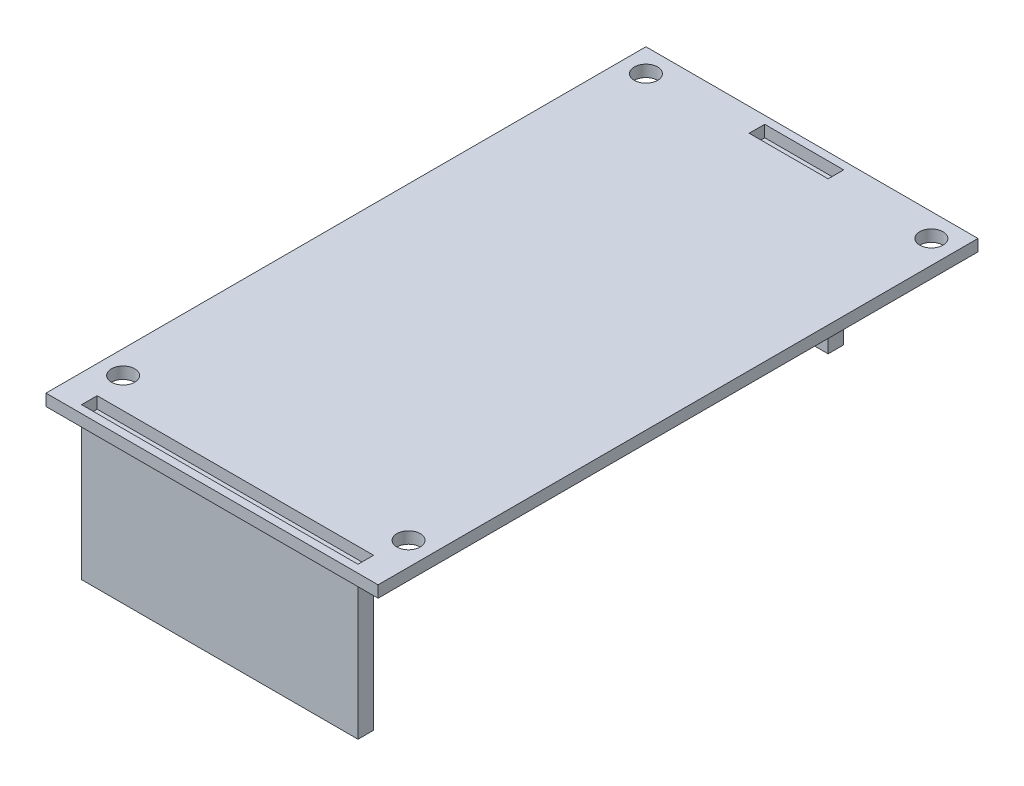
ISO-10303-21;
HEADER;
FILE_DESCRIPTION(('STEP AP214'),'2;1');
FILE_NAME('part.step','',(''),(''),'','','');
FILE_SCHEMA(('AUTOMOTIVE_DESIGN { 1 0 10303 214 1 1 1 1 }'));
ENDSEC;
DATA;
#1=APPLICATION_CONTEXT('core data for automotive mechanical design processes');
#2=APPLICATION_PROTOCOL_DEFINITION('international standard','automotive_design',2000,#1);
#3=PRODUCT_CONTEXT('',#1,'mechanical');
#4=PRODUCT('Part','Part','',(#3));
#5=PRODUCT_RELATED_PRODUCT_CATEGORY('part','',(#4));
#6=PRODUCT_DEFINITION_FORMATION('','',#4);
#7=PRODUCT_DEFINITION_CONTEXT('part definition',#1,'design');
#8=PRODUCT_DEFINITION('design','',#6,#7);
#9=PRODUCT_DEFINITION_SHAPE('','',#8);
#10=(LENGTH_UNIT() NAMED_UNIT(*) SI_UNIT(.MILLI.,.METRE.));
#11=(NAMED_UNIT(*) PLANE_ANGLE_UNIT() SI_UNIT($,.RADIAN.));
#12=(NAMED_UNIT(*) SI_UNIT($,.STERADIAN.) SOLID_ANGLE_UNIT());
#13=UNCERTAINTY_MEASURE_WITH_UNIT(LENGTH_MEASURE(1.E-05),#10,'distance_accuracy_value','');
#14=(GEOMETRIC_REPRESENTATION_CONTEXT(3) GLOBAL_UNCERTAINTY_ASSIGNED_CONTEXT((#13)) GLOBAL_UNIT_ASSIGNED_CONTEXT((#10,
#11,#12)) REPRESENTATION_CONTEXT('',''));
#15=CARTESIAN_POINT('',(0.,0.,0.));
#16=DIRECTION('',(0.,0.,1.));
#17=DIRECTION('',(1.,0.,0.));
#18=AXIS2_PLACEMENT_3D('',#15,#16,#17);
#19=CARTESIAN_POINT('',(26.44,-18.,-74.18));
#20=DIRECTION('',(-1.,0.,0.));
#21=DIRECTION('',(0.,0.,1.));
#22=AXIS2_PLACEMENT_3D('',#19,#20,#21);
#23=PLANE('',#22);
#24=DIRECTION('',(0.,0.,1.));
#25=VECTOR('',#24,1.);
#26=CARTESIAN_POINT('',(26.44,0.,-74.18));
#27=LINE('',#26,#25);
#28=CARTESIAN_POINT('',(26.44,0.,-76.18));
#29=VERTEX_POINT('',#28);
#30=CARTESIAN_POINT('',(26.44,0.,-74.18));
#31=VERTEX_POINT('',#30);
#32=EDGE_CURVE('E107',#29,#31,#27,.T.);
#33=ORIENTED_EDGE('',*,*,#32,.T.);
#34=DIRECTION('',(0.,1.,0.));
#35=VECTOR('',#34,1.);
#36=CARTESIAN_POINT('',(26.44,-18.,-74.18));
#37=LINE('',#36,#35);
#38=CARTESIAN_POINT('',(26.44,-18.,-74.18));
#39=VERTEX_POINT('',#38);
#40=EDGE_CURVE('E12',#39,#31,#37,.T.);
#41=ORIENTED_EDGE('',*,*,#40,.F.);
#42=DIRECTION('',(0.,0.,1.));
#43=VECTOR('',#42,1.);
#44=CARTESIAN_POINT('',(26.44,-18.,-74.18));
#45=LINE('',#44,#43);
#46=CARTESIAN_POINT('',(26.44,-18.,-76.18));
#47=VERTEX_POINT('',#46);
#48=EDGE_CURVE('E95',#47,#39,#45,.T.);
#49=ORIENTED_EDGE('',*,*,#48,.F.);
#50=DIRECTION('',(0.,1.,0.));
#51=VECTOR('',#50,1.);
#52=CARTESIAN_POINT('',(26.44,-18.,-76.18));
#53=LINE('',#52,#51);
#54=EDGE_CURVE('E103',#47,#29,#53,.T.);
#55=ORIENTED_EDGE('',*,*,#54,.T.);
#56=EDGE_LOOP('',(#33,#41,#49,#55));
#57=FACE_BOUND('',#56,.T.);
#58=ADVANCED_FACE('F44',(#57),#23,.F.);
#59=CARTESIAN_POINT('',(26.44,-18.,-74.18));
#60=DIRECTION('',(0.,0.,-1.));
#61=DIRECTION('',(-1.,0.,0.));
#62=AXIS2_PLACEMENT_3D('',#59,#60,#61);
#63=PLANE('',#62);
#64=DIRECTION('',(-1.,0.,0.));
#65=VECTOR('',#64,1.);
#66=CARTESIAN_POINT('',(26.44,0.,-74.18));
#67=LINE('',#66,#65);
#68=CARTESIAN_POINT('',(16.28,0.,-74.18));
#69=VERTEX_POINT('',#68);
#70=EDGE_CURVE('E99',#31,#69,#67,.T.);
#71=ORIENTED_EDGE('',*,*,#70,.T.);
#72=DIRECTION('',(0.,1.,0.));
#73=VECTOR('',#72,1.);
#74=CARTESIAN_POINT('',(16.28,-18.,-74.18));
#75=LINE('',#74,#73);
#76=CARTESIAN_POINT('',(16.28,-18.,-74.18));
#77=VERTEX_POINT('',#76);
#78=EDGE_CURVE('E52',#77,#69,#75,.T.);
#79=ORIENTED_EDGE('',*,*,#78,.F.);
#80=DIRECTION('',(-1.,0.,0.));
#81=VECTOR('',#80,1.);
#82=CARTESIAN_POINT('',(26.44,-18.,-74.18));
#83=LINE('',#82,#81);
#84=EDGE_CURVE('E90',#39,#77,#83,.T.);
#85=ORIENTED_EDGE('',*,*,#84,.F.);
#86=ORIENTED_EDGE('',*,*,#40,.T.);
#87=EDGE_LOOP('',(#71,#79,#85,#86));
#88=FACE_BOUND('',#87,.T.);
#89=ADVANCED_FACE('F98',(#88),#63,.F.);
#90=CARTESIAN_POINT('',(16.28,-18.,-74.18));
#91=DIRECTION('',(1.,0.,0.));
#92=DIRECTION('',(0.,0.,-1.));
#93=AXIS2_PLACEMENT_3D('',#90,#91,#92);
#94=PLANE('',#93);
#95=DIRECTION('',(0.,0.,-1.));
#96=VECTOR('',#95,1.);
#97=CARTESIAN_POINT('',(16.28,0.,-74.18));
#98=LINE('',#97,#96);
#99=CARTESIAN_POINT('',(16.28,0.,-76.18));
#100=VERTEX_POINT('',#99);
#101=EDGE_CURVE('E77',#69,#100,#98,.T.);
#102=ORIENTED_EDGE('',*,*,#101,.T.);
#103=DIRECTION('',(0.,1.,0.));
#104=VECTOR('',#103,1.);
#105=CARTESIAN_POINT('',(16.28,-18.,-76.18));
#106=LINE('',#105,#104);
#107=CARTESIAN_POINT('',(16.28,-18.,-76.18));
#108=VERTEX_POINT('',#107);
#109=EDGE_CURVE('E100',#108,#100,#106,.T.);
#110=ORIENTED_EDGE('',*,*,#109,.F.);
#111=DIRECTION('',(0.,0.,-1.));
#112=VECTOR('',#111,1.);
#113=CARTESIAN_POINT('',(16.28,-18.,-74.18));
#114=LINE('',#113,#112);
#115=EDGE_CURVE('E93',#77,#108,#114,.T.);
#116=ORIENTED_EDGE('',*,*,#115,.F.);
#117=ORIENTED_EDGE('',*,*,#78,.T.);
#118=EDGE_LOOP('',(#102,#110,#116,#117));
#119=FACE_BOUND('',#118,.T.);
#120=ADVANCED_FACE('F101',(#119),#94,.F.);
#121=CARTESIAN_POINT('',(26.44,-18.,-76.18));
#122=DIRECTION('',(0.,0.,1.));
#123=DIRECTION('',(1.,0.,0.));
#124=AXIS2_PLACEMENT_3D('',#121,#122,#123);
#125=PLANE('',#124);
#126=DIRECTION('',(1.,0.,0.));
#127=VECTOR('',#126,1.);
#128=CARTESIAN_POINT('',(26.44,0.,-76.18));
#129=LINE('',#128,#127);
#130=EDGE_CURVE('E83',#100,#29,#129,.T.);
#131=ORIENTED_EDGE('',*,*,#130,.T.);
#132=ORIENTED_EDGE('',*,*,#54,.F.);
#133=DIRECTION('',(1.,0.,0.));
#134=VECTOR('',#133,1.);
#135=CARTESIAN_POINT('',(26.44,-18.,-76.18));
#136=LINE('',#135,#134);
#137=EDGE_CURVE('E60',#108,#47,#136,.T.);
#138=ORIENTED_EDGE('',*,*,#137,.F.);
#139=ORIENTED_EDGE('',*,*,#109,.T.);
#140=EDGE_LOOP('',(#131,#132,#138,#139));
#141=FACE_BOUND('',#140,.T.);
#142=ADVANCED_FACE('F114',(#141),#125,.F.);
#143=CARTESIAN_POINT('',(0.,-18.,0.));
#144=DIRECTION('',(0.,1.,0.));
#145=DIRECTION('',(0.,0.,1.));
#146=AXIS2_PLACEMENT_3D('',#143,#144,#145);
#147=PLANE('',#146);
#148=ORIENTED_EDGE('',*,*,#48,.T.);
#149=ORIENTED_EDGE('',*,*,#84,.T.);
#150=ORIENTED_EDGE('',*,*,#115,.T.);
#151=ORIENTED_EDGE('',*,*,#137,.T.);
#152=EDGE_LOOP('',(#148,#149,#150,#151));
#153=FACE_BOUND('',#152,.T.);
#154=ADVANCED_FACE('F91',(#153),#147,.F.);
#155=CARTESIAN_POINT('',(0.,0.,0.));
#156=DIRECTION('',(0.,1.,0.));
#157=DIRECTION('',(0.,0.,1.));
#158=AXIS2_PLACEMENT_3D('',#155,#156,#157);
#159=PLANE('',#158);
#160=ORIENTED_EDGE('',*,*,#32,.F.);
#161=ORIENTED_EDGE('',*,*,#130,.F.);
#162=ORIENTED_EDGE('',*,*,#101,.F.);
#163=ORIENTED_EDGE('',*,*,#70,.F.);
#164=EDGE_LOOP('',(#160,#161,#162,#163));
#165=FACE_BOUND('',#164,.T.);
#166=ADVANCED_FACE('F117',(#165),#159,.T.);
#167=CLOSED_SHELL('',(#58,#89,#120,#142,#154,#166));
#168=MANIFOLD_SOLID_BREP('B2',#167);
#169=CARTESIAN_POINT('',(39.14,-18.,-1.));
#170=DIRECTION('',(-1.,0.,0.));
#171=DIRECTION('',(0.,0.,1.));
#172=AXIS2_PLACEMENT_3D('',#169,#170,#171);
#173=PLANE('',#172);
#174=DIRECTION('',(0.,0.,1.));
#175=VECTOR('',#174,1.);
#176=CARTESIAN_POINT('',(39.14,0.,-1.));
#177=LINE('',#176,#175);
#178=CARTESIAN_POINT('',(39.14,0.,-3.));
#179=VERTEX_POINT('',#178);
#180=CARTESIAN_POINT('',(39.14,0.,-1.));
#181=VERTEX_POINT('',#180);
#182=EDGE_CURVE('E240',#179,#181,#177,.T.);
#183=ORIENTED_EDGE('',*,*,#182,.T.);
#184=DIRECTION('',(0.,1.,0.));
#185=VECTOR('',#184,1.);
#186=CARTESIAN_POINT('',(39.14,-18.,-1.));
#187=LINE('',#186,#185);
#188=CARTESIAN_POINT('',(39.14,-18.,-1.));
#189=VERTEX_POINT('',#188);
#190=EDGE_CURVE('E42',#189,#181,#187,.T.);
#191=ORIENTED_EDGE('',*,*,#190,.F.);
#192=DIRECTION('',(0.,0.,1.));
#193=VECTOR('',#192,1.);
#194=CARTESIAN_POINT('',(39.14,-18.,-1.));
#195=LINE('',#194,#193);
#196=CARTESIAN_POINT('',(39.14,-18.,-3.));
#197=VERTEX_POINT('',#196);
#198=EDGE_CURVE('E228',#197,#189,#195,.T.);
#199=ORIENTED_EDGE('',*,*,#198,.F.);
#200=DIRECTION('',(0.,1.,0.));
#201=VECTOR('',#200,1.);
#202=CARTESIAN_POINT('',(39.14,-18.,-3.));
#203=LINE('',#202,#201);
#204=EDGE_CURVE('E236',#197,#179,#203,.T.);
#205=ORIENTED_EDGE('',*,*,#204,.T.);
#206=EDGE_LOOP('',(#183,#191,#199,#205));
#207=FACE_BOUND('',#206,.T.);
#208=ADVANCED_FACE('F177',(#207),#173,.F.);
#209=CARTESIAN_POINT('',(39.14,-18.,-1.));
#210=DIRECTION('',(0.,0.,-1.));
#211=DIRECTION('',(-1.,0.,0.));
#212=AXIS2_PLACEMENT_3D('',#209,#210,#211);
#213=PLANE('',#212);
#214=DIRECTION('',(-1.,0.,0.));
#215=VECTOR('',#214,1.);
#216=CARTESIAN_POINT('',(39.14,0.,-1.));
#217=LINE('',#216,#215);
#218=CARTESIAN_POINT('',(3.58,0.,-1.));
#219=VERTEX_POINT('',#218);
#220=EDGE_CURVE('E232',#181,#219,#217,.T.);
#221=ORIENTED_EDGE('',*,*,#220,.T.);
#222=DIRECTION('',(0.,1.,0.));
#223=VECTOR('',#222,1.);
#224=CARTESIAN_POINT('',(3.58,-18.,-1.));
#225=LINE('',#224,#223);
#226=CARTESIAN_POINT('',(3.58,-18.,-1.));
#227=VERTEX_POINT('',#226);
#228=EDGE_CURVE('E185',#227,#219,#225,.T.);
#229=ORIENTED_EDGE('',*,*,#228,.F.);
#230=DIRECTION('',(-1.,0.,0.));
#231=VECTOR('',#230,1.);
#232=CARTESIAN_POINT('',(39.14,-18.,-1.));
#233=LINE('',#232,#231);
#234=EDGE_CURVE('E223',#189,#227,#233,.T.);
#235=ORIENTED_EDGE('',*,*,#234,.F.);
#236=ORIENTED_EDGE('',*,*,#190,.T.);
#237=EDGE_LOOP('',(#221,#229,#235,#236));
#238=FACE_BOUND('',#237,.T.);
#239=ADVANCED_FACE('F231',(#238),#213,.F.);
#240=CARTESIAN_POINT('',(3.58,-18.,-1.));
#241=DIRECTION('',(1.,0.,0.));
#242=DIRECTION('',(0.,0.,-1.));
#243=AXIS2_PLACEMENT_3D('',#240,#241,#242);
#244=PLANE('',#243);
#245=DIRECTION('',(0.,0.,-1.));
#246=VECTOR('',#245,1.);
#247=CARTESIAN_POINT('',(3.58,0.,-1.));
#248=LINE('',#247,#246);
#249=CARTESIAN_POINT('',(3.58,0.,-3.));
#250=VERTEX_POINT('',#249);
#251=EDGE_CURVE('E210',#219,#250,#248,.T.);
#252=ORIENTED_EDGE('',*,*,#251,.T.);
#253=DIRECTION('',(0.,1.,0.));
#254=VECTOR('',#253,1.);
#255=CARTESIAN_POINT('',(3.58,-18.,-3.));
#256=LINE('',#255,#254);
#257=CARTESIAN_POINT('',(3.58,-18.,-3.));
#258=VERTEX_POINT('',#257);
#259=EDGE_CURVE('E233',#258,#250,#256,.T.);
#260=ORIENTED_EDGE('',*,*,#259,.F.);
#261=DIRECTION('',(0.,0.,-1.));
#262=VECTOR('',#261,1.);
#263=CARTESIAN_POINT('',(3.58,-18.,-1.));
#264=LINE('',#263,#262);
#265=EDGE_CURVE('E226',#227,#258,#264,.T.);
#266=ORIENTED_EDGE('',*,*,#265,.F.);
#267=ORIENTED_EDGE('',*,*,#228,.T.);
#268=EDGE_LOOP('',(#252,#260,#266,#267));
#269=FACE_BOUND('',#268,.T.);
#270=ADVANCED_FACE('F234',(#269),#244,.F.);
#271=CARTESIAN_POINT('',(39.14,-18.,-3.));
#272=DIRECTION('',(0.,0.,1.));
#273=DIRECTION('',(1.,0.,0.));
#274=AXIS2_PLACEMENT_3D('',#271,#272,#273);
#275=PLANE('',#274);
#276=DIRECTION('',(1.,0.,0.));
#277=VECTOR('',#276,1.);
#278=CARTESIAN_POINT('',(39.14,0.,-3.));
#279=LINE('',#278,#277);
#280=EDGE_CURVE('E216',#250,#179,#279,.T.);
#281=ORIENTED_EDGE('',*,*,#280,.T.);
#282=ORIENTED_EDGE('',*,*,#204,.F.);
#283=DIRECTION('',(1.,0.,0.));
#284=VECTOR('',#283,1.);
#285=CARTESIAN_POINT('',(39.14,-18.,-3.));
#286=LINE('',#285,#284);
#287=EDGE_CURVE('E193',#258,#197,#286,.T.);
#288=ORIENTED_EDGE('',*,*,#287,.F.);
#289=ORIENTED_EDGE('',*,*,#259,.T.);
#290=EDGE_LOOP('',(#281,#282,#288,#289));
#291=FACE_BOUND('',#290,.T.);
#292=ADVANCED_FACE('F247',(#291),#275,.F.);
#293=CARTESIAN_POINT('',(0.,-18.,0.));
#294=DIRECTION('',(0.,1.,0.));
#295=DIRECTION('',(0.,0.,1.));
#296=AXIS2_PLACEMENT_3D('',#293,#294,#295);
#297=PLANE('',#296);
#298=ORIENTED_EDGE('',*,*,#198,.T.);
#299=ORIENTED_EDGE('',*,*,#234,.T.);
#300=ORIENTED_EDGE('',*,*,#265,.T.);
#301=ORIENTED_EDGE('',*,*,#287,.T.);
#302=EDGE_LOOP('',(#298,#299,#300,#301));
#303=FACE_BOUND('',#302,.T.);
#304=ADVANCED_FACE('F224',(#303),#297,.F.);
#305=CARTESIAN_POINT('',(0.,0.,0.));
#306=DIRECTION('',(0.,1.,0.));
#307=DIRECTION('',(0.,0.,1.));
#308=AXIS2_PLACEMENT_3D('',#305,#306,#307);
#309=PLANE('',#308);
#310=ORIENTED_EDGE('',*,*,#182,.F.);
#311=ORIENTED_EDGE('',*,*,#280,.F.);
#312=ORIENTED_EDGE('',*,*,#251,.F.);
#313=ORIENTED_EDGE('',*,*,#220,.F.);
#314=EDGE_LOOP('',(#310,#311,#312,#313));
#315=FACE_BOUND('',#314,.T.);
#316=ADVANCED_FACE('F250',(#315),#309,.T.);
#317=CLOSED_SHELL('',(#208,#239,#270,#292,#304,#316));
#318=MANIFOLD_SOLID_BREP('B6',#317);
#319=CARTESIAN_POINT('',(0.,1.5,0.));
#320=DIRECTION('',(0.,-1.,0.));
#321=DIRECTION('',(0.,0.,-1.));
#322=AXIS2_PLACEMENT_3D('',#319,#320,#321);
#323=PLANE('',#322);
#324=DIRECTION('',(0.,0.,1.));
#325=VECTOR('',#324,1.);
#326=CARTESIAN_POINT('',(3.58,1.5,-1.));
#327=LINE('',#326,#325);
#328=CARTESIAN_POINT('',(3.58,1.5,-3.));
#329=VERTEX_POINT('',#328);
#330=CARTESIAN_POINT('',(3.58,1.5,-1.));
#331=VERTEX_POINT('',#330);
#332=EDGE_CURVE('E426',#329,#331,#327,.T.);
#333=ORIENTED_EDGE('',*,*,#332,.F.);
#334=DIRECTION('',(-1.,0.,0.));
#335=VECTOR('',#334,1.);
#336=CARTESIAN_POINT('',(3.58,1.5,-3.));
#337=LINE('',#336,#335);
#338=CARTESIAN_POINT('',(39.14,1.5,-3.));
#339=VERTEX_POINT('',#338);
#340=EDGE_CURVE('E434',#339,#329,#337,.T.);
#341=ORIENTED_EDGE('',*,*,#340,.F.);
#342=DIRECTION('',(0.,0.,-1.));
#343=VECTOR('',#342,1.);
#344=CARTESIAN_POINT('',(39.14,1.5,-1.));
#345=LINE('',#344,#343);
#346=CARTESIAN_POINT('',(39.14,1.5,-1.));
#347=VERTEX_POINT('',#346);
#348=EDGE_CURVE('E431',#347,#339,#345,.T.);
#349=ORIENTED_EDGE('',*,*,#348,.F.);
#350=DIRECTION('',(1.,0.,0.));
#351=VECTOR('',#350,1.);
#352=CARTESIAN_POINT('',(3.58,1.5,-1.));
#353=LINE('',#352,#351);
#354=EDGE_CURVE('E428',#331,#347,#353,.T.);
#355=ORIENTED_EDGE('',*,*,#354,.F.);
#356=EDGE_LOOP('',(#333,#341,#349,#355));
#357=FACE_BOUND('',#356,.T.);
#358=DIRECTION('',(0.,0.,1.));
#359=VECTOR('',#358,1.);
#360=CARTESIAN_POINT('',(0.,1.5,0.));
#361=LINE('',#360,#359);
#362=CARTESIAN_POINT('',(0.,1.5,-77.18));
#363=VERTEX_POINT('',#362);
#364=CARTESIAN_POINT('',(0.,1.5,0.));
#365=VERTEX_POINT('',#364);
#366=EDGE_CURVE('E481',#363,#365,#361,.T.);
#367=ORIENTED_EDGE('',*,*,#366,.T.);
#368=DIRECTION('',(1.,0.,0.));
#369=VECTOR('',#368,1.);
#370=CARTESIAN_POINT('',(0.,1.5,0.));
#371=LINE('',#370,#369);
#372=CARTESIAN_POINT('',(42.72,1.5,0.));
#373=VERTEX_POINT('',#372);
#374=EDGE_CURVE('E484',#365,#373,#371,.T.);
#375=ORIENTED_EDGE('',*,*,#374,.T.);
#376=DIRECTION('',(0.,0.,-1.));
#377=VECTOR('',#376,1.);
#378=CARTESIAN_POINT('',(42.72,1.5,0.));
#379=LINE('',#378,#377);
#380=CARTESIAN_POINT('',(42.72,1.5,-77.18));
#381=VERTEX_POINT('',#380);
#382=EDGE_CURVE('E487',#373,#381,#379,.T.);
#383=ORIENTED_EDGE('',*,*,#382,.T.);
#384=DIRECTION('',(-1.,0.,0.));
#385=VECTOR('',#384,1.);
#386=CARTESIAN_POINT('',(0.,1.5,-77.18));
#387=LINE('',#386,#385);
#388=EDGE_CURVE('E489',#381,#363,#387,.T.);
#389=ORIENTED_EDGE('',*,*,#388,.T.);
#390=EDGE_LOOP('',(#367,#375,#383,#389));
#391=FACE_BOUND('',#390,.T.);
#392=CARTESIAN_POINT('',(39.72,1.5,-74.18));
#393=DIRECTION('',(0.,1.,0.));
#394=DIRECTION('',(0.,0.,1.));
#395=AXIS2_PLACEMENT_3D('',#392,#393,#394);
#396=CIRCLE('',#395,1.5);
#397=CARTESIAN_POINT('',(39.72,1.5,-72.68));
#398=VERTEX_POINT('',#397);
#399=EDGE_CURVE('E475',#398,#398,#396,.T.);
#400=ORIENTED_EDGE('',*,*,#399,.F.);
#401=EDGE_LOOP('',(#400));
#402=FACE_BOUND('',#401,.T.);
#403=CARTESIAN_POINT('',(3.,1.5,-74.18));
#404=DIRECTION('',(0.,1.,0.));
#405=DIRECTION('',(0.,0.,1.));
#406=AXIS2_PLACEMENT_3D('',#403,#404,#405);
#407=CIRCLE('',#406,1.5);
#408=CARTESIAN_POINT('',(3.,1.5,-72.68));
#409=VERTEX_POINT('',#408);
#410=EDGE_CURVE('E469',#409,#409,#407,.T.);
#411=ORIENTED_EDGE('',*,*,#410,.F.);
#412=EDGE_LOOP('',(#411));
#413=FACE_BOUND('',#412,.T.);
#414=CARTESIAN_POINT('',(3.,1.5,-6.92));
#415=DIRECTION('',(0.,1.,0.));
#416=DIRECTION('',(0.,0.,1.));
#417=AXIS2_PLACEMENT_3D('',#414,#415,#416);
#418=CIRCLE('',#417,1.5);
#419=CARTESIAN_POINT('',(3.,1.5,-5.42));
#420=VERTEX_POINT('',#419);
#421=EDGE_CURVE('E463',#420,#420,#418,.T.);
#422=ORIENTED_EDGE('',*,*,#421,.F.);
#423=EDGE_LOOP('',(#422));
#424=FACE_BOUND('',#423,.T.);
#425=CARTESIAN_POINT('',(39.72,1.5,-6.92));
#426=DIRECTION('',(0.,1.,0.));
#427=DIRECTION('',(0.,0.,1.));
#428=AXIS2_PLACEMENT_3D('',#425,#426,#427);
#429=CIRCLE('',#428,1.5);
#430=CARTESIAN_POINT('',(39.72,1.5,-5.42));
#431=VERTEX_POINT('',#430);
#432=EDGE_CURVE('E457',#431,#431,#429,.T.);
#433=ORIENTED_EDGE('',*,*,#432,.F.);
#434=EDGE_LOOP('',(#433));
#435=FACE_BOUND('',#434,.T.);
#436=DIRECTION('',(0.,0.,1.));
#437=VECTOR('',#436,1.);
#438=CARTESIAN_POINT('',(16.28,1.5,-76.18));
#439=LINE('',#438,#437);
#440=CARTESIAN_POINT('',(16.28,1.5,-76.18));
#441=VERTEX_POINT('',#440);
#442=CARTESIAN_POINT('',(16.28,1.5,-74.18));
#443=VERTEX_POINT('',#442);
#444=EDGE_CURVE('E390',#441,#443,#439,.T.);
#445=ORIENTED_EDGE('',*,*,#444,.F.);
#446=DIRECTION('',(-1.,0.,0.));
#447=VECTOR('',#446,1.);
#448=CARTESIAN_POINT('',(16.28,1.5,-76.18));
#449=LINE('',#448,#447);
#450=CARTESIAN_POINT('',(26.44,1.5,-76.18));
#451=VERTEX_POINT('',#450);
#452=EDGE_CURVE('E412',#451,#441,#449,.T.);
#453=ORIENTED_EDGE('',*,*,#452,.F.);
#454=DIRECTION('',(0.,0.,-1.));
#455=VECTOR('',#454,1.);
#456=CARTESIAN_POINT('',(26.44,1.5,-76.18));
#457=LINE('',#456,#455);
#458=CARTESIAN_POINT('',(26.44,1.5,-74.18));
#459=VERTEX_POINT('',#458);
#460=EDGE_CURVE('E410',#459,#451,#457,.T.);
#461=ORIENTED_EDGE('',*,*,#460,.F.);
#462=DIRECTION('',(1.,0.,0.));
#463=VECTOR('',#462,1.);
#464=CARTESIAN_POINT('',(16.28,1.5,-74.18));
#465=LINE('',#464,#463);
#466=EDGE_CURVE('E398',#443,#459,#465,.T.);
#467=ORIENTED_EDGE('',*,*,#466,.F.);
#468=EDGE_LOOP('',(#445,#453,#461,#467));
#469=FACE_BOUND('',#468,.T.);
#470=ADVANCED_FACE('F301',(#357,#391,#402,#413,#424,#435,#469),#323,.F.);
#471=CARTESIAN_POINT('',(0.,0.,0.));
#472=DIRECTION('',(0.,-1.,0.));
#473=DIRECTION('',(0.,0.,-1.));
#474=AXIS2_PLACEMENT_3D('',#471,#472,#473);
#475=PLANE('',#474);
#476=CARTESIAN_POINT('',(3.,0.,-6.92));
#477=DIRECTION('',(0.,1.,0.));
#478=DIRECTION('',(0.,0.,1.));
#479=AXIS2_PLACEMENT_3D('',#476,#477,#478);
#480=CIRCLE('',#479,1.5);
#481=CARTESIAN_POINT('',(3.,0.,-5.42));
#482=VERTEX_POINT('',#481);
#483=EDGE_CURVE('E460',#482,#482,#480,.T.);
#484=ORIENTED_EDGE('',*,*,#483,.T.);
#485=EDGE_LOOP('',(#484));
#486=FACE_BOUND('',#485,.T.);
#487=CARTESIAN_POINT('',(39.72,0.,-74.18));
#488=DIRECTION('',(0.,1.,0.));
#489=DIRECTION('',(0.,0.,1.));
#490=AXIS2_PLACEMENT_3D('',#487,#488,#489);
#491=CIRCLE('',#490,1.5);
#492=CARTESIAN_POINT('',(39.72,0.,-72.68));
#493=VERTEX_POINT('',#492);
#494=EDGE_CURVE('E472',#493,#493,#491,.T.);
#495=ORIENTED_EDGE('',*,*,#494,.T.);
#496=EDGE_LOOP('',(#495));
#497=FACE_BOUND('',#496,.T.);
#498=DIRECTION('',(0.,0.,1.));
#499=VECTOR('',#498,1.);
#500=CARTESIAN_POINT('',(0.,0.,0.));
#501=LINE('',#500,#499);
#502=CARTESIAN_POINT('',(0.,0.,-77.18));
#503=VERTEX_POINT('',#502);
#504=CARTESIAN_POINT('',(0.,0.,0.));
#505=VERTEX_POINT('',#504);
#506=EDGE_CURVE('E478',#503,#505,#501,.T.);
#507=ORIENTED_EDGE('',*,*,#506,.F.);
#508=DIRECTION('',(-1.,0.,0.));
#509=VECTOR('',#508,1.);
#510=CARTESIAN_POINT('',(0.,0.,-77.18));
#511=LINE('',#510,#509);
#512=CARTESIAN_POINT('',(42.72,0.,-77.18));
#513=VERTEX_POINT('',#512);
#514=EDGE_CURVE('E485',#513,#503,#511,.T.);
#515=ORIENTED_EDGE('',*,*,#514,.F.);
#516=DIRECTION('',(0.,0.,-1.));
#517=VECTOR('',#516,1.);
#518=CARTESIAN_POINT('',(42.72,0.,0.));
#519=LINE('',#518,#517);
#520=CARTESIAN_POINT('',(42.72,0.,0.));
#521=VERTEX_POINT('',#520);
#522=EDGE_CURVE('E496',#521,#513,#519,.T.);
#523=ORIENTED_EDGE('',*,*,#522,.F.);
#524=DIRECTION('',(1.,0.,0.));
#525=VECTOR('',#524,1.);
#526=CARTESIAN_POINT('',(0.,0.,0.));
#527=LINE('',#526,#525);
#528=EDGE_CURVE('E494',#505,#521,#527,.T.);
#529=ORIENTED_EDGE('',*,*,#528,.F.);
#530=EDGE_LOOP('',(#507,#515,#523,#529));
#531=FACE_BOUND('',#530,.T.);
#532=CARTESIAN_POINT('',(3.,0.,-74.18));
#533=DIRECTION('',(0.,1.,0.));
#534=DIRECTION('',(0.,0.,1.));
#535=AXIS2_PLACEMENT_3D('',#532,#533,#534);
#536=CIRCLE('',#535,1.5);
#537=CARTESIAN_POINT('',(3.,0.,-72.68));
#538=VERTEX_POINT('',#537);
#539=EDGE_CURVE('E466',#538,#538,#536,.T.);
#540=ORIENTED_EDGE('',*,*,#539,.T.);
#541=EDGE_LOOP('',(#540));
#542=FACE_BOUND('',#541,.T.);
#543=CARTESIAN_POINT('',(39.72,0.,-6.92));
#544=DIRECTION('',(0.,1.,0.));
#545=DIRECTION('',(0.,0.,1.));
#546=AXIS2_PLACEMENT_3D('',#543,#544,#545);
#547=CIRCLE('',#546,1.5);
#548=CARTESIAN_POINT('',(39.72,0.,-5.42));
#549=VERTEX_POINT('',#548);
#550=EDGE_CURVE('E456',#549,#549,#547,.T.);
#551=ORIENTED_EDGE('',*,*,#550,.T.);
#552=EDGE_LOOP('',(#551));
#553=FACE_BOUND('',#552,.T.);
#554=DIRECTION('',(-1.,0.,0.));
#555=VECTOR('',#554,1.);
#556=CARTESIAN_POINT('',(3.58,0.,-3.));
#557=LINE('',#556,#555);
#558=CARTESIAN_POINT('',(39.14,0.,-3.));
#559=VERTEX_POINT('',#558);
#560=CARTESIAN_POINT('',(3.58,0.,-3.));
#561=VERTEX_POINT('',#560);
#562=EDGE_CURVE('E429',#559,#561,#557,.T.);
#563=ORIENTED_EDGE('',*,*,#562,.T.);
#564=DIRECTION('',(0.,0.,1.));
#565=VECTOR('',#564,1.);
#566=CARTESIAN_POINT('',(3.58,0.,-1.));
#567=LINE('',#566,#565);
#568=CARTESIAN_POINT('',(3.58,0.,-1.));
#569=VERTEX_POINT('',#568);
#570=EDGE_CURVE('E406',#561,#569,#567,.T.);
#571=ORIENTED_EDGE('',*,*,#570,.T.);
#572=DIRECTION('',(1.,0.,0.));
#573=VECTOR('',#572,1.);
#574=CARTESIAN_POINT('',(3.58,0.,-1.));
#575=LINE('',#574,#573);
#576=CARTESIAN_POINT('',(39.14,0.,-1.));
#577=VERTEX_POINT('',#576);
#578=EDGE_CURVE('E439',#569,#577,#575,.T.);
#579=ORIENTED_EDGE('',*,*,#578,.T.);
#580=DIRECTION('',(0.,0.,-1.));
#581=VECTOR('',#580,1.);
#582=CARTESIAN_POINT('',(39.14,0.,-1.));
#583=LINE('',#582,#581);
#584=EDGE_CURVE('E442',#577,#559,#583,.T.);
#585=ORIENTED_EDGE('',*,*,#584,.T.);
#586=EDGE_LOOP('',(#563,#571,#579,#585));
#587=FACE_BOUND('',#586,.T.);
#588=DIRECTION('',(-1.,0.,0.));
#589=VECTOR('',#588,1.);
#590=CARTESIAN_POINT('',(16.28,0.,-76.18));
#591=LINE('',#590,#589);
#592=CARTESIAN_POINT('',(26.44,0.,-76.18));
#593=VERTEX_POINT('',#592);
#594=CARTESIAN_POINT('',(16.28,0.,-76.18));
#595=VERTEX_POINT('',#594);
#596=EDGE_CURVE('E399',#593,#595,#591,.T.);
#597=ORIENTED_EDGE('',*,*,#596,.T.);
#598=DIRECTION('',(0.,0.,1.));
#599=VECTOR('',#598,1.);
#600=CARTESIAN_POINT('',(16.28,0.,-76.18));
#601=LINE('',#600,#599);
#602=CARTESIAN_POINT('',(16.28,0.,-74.18));
#603=VERTEX_POINT('',#602);
#604=EDGE_CURVE('E324',#595,#603,#601,.T.);
#605=ORIENTED_EDGE('',*,*,#604,.T.);
#606=DIRECTION('',(1.,0.,0.));
#607=VECTOR('',#606,1.);
#608=CARTESIAN_POINT('',(16.28,0.,-74.18));
#609=LINE('',#608,#607);
#610=CARTESIAN_POINT('',(26.44,0.,-74.18));
#611=VERTEX_POINT('',#610);
#612=EDGE_CURVE('E405',#603,#611,#609,.T.);
#613=ORIENTED_EDGE('',*,*,#612,.T.);
#614=DIRECTION('',(0.,0.,-1.));
#615=VECTOR('',#614,1.);
#616=CARTESIAN_POINT('',(26.44,0.,-76.18));
#617=LINE('',#616,#615);
#618=EDGE_CURVE('E418',#611,#593,#617,.T.);
#619=ORIENTED_EDGE('',*,*,#618,.T.);
#620=EDGE_LOOP('',(#597,#605,#613,#619));
#621=FACE_BOUND('',#620,.T.);
#622=ADVANCED_FACE('F514',(#486,#497,#531,#542,#553,#587,#621),#475,.T.);
#623=CARTESIAN_POINT('',(0.,1.5,0.));
#624=DIRECTION('',(1.,0.,0.));
#625=DIRECTION('',(0.,0.,-1.));
#626=AXIS2_PLACEMENT_3D('',#623,#624,#625);
#627=PLANE('',#626);
#628=ORIENTED_EDGE('',*,*,#506,.T.);
#629=DIRECTION('',(0.,-1.,0.));
#630=VECTOR('',#629,1.);
#631=CARTESIAN_POINT('',(0.,1.5,0.));
#632=LINE('',#631,#630);
#633=EDGE_CURVE('E175',#365,#505,#632,.T.);
#634=ORIENTED_EDGE('',*,*,#633,.F.);
#635=ORIENTED_EDGE('',*,*,#366,.F.);
#636=DIRECTION('',(0.,-1.,0.));
#637=VECTOR('',#636,1.);
#638=CARTESIAN_POINT('',(0.,1.5,-77.18));
#639=LINE('',#638,#637);
#640=EDGE_CURVE('E491',#363,#503,#639,.T.);
#641=ORIENTED_EDGE('',*,*,#640,.T.);
#642=EDGE_LOOP('',(#628,#634,#635,#641));
#643=FACE_BOUND('',#642,.T.);
#644=ADVANCED_FACE('F303',(#643),#627,.F.);
#645=CARTESIAN_POINT('',(0.,1.5,0.));
#646=DIRECTION('',(0.,0.,-1.));
#647=DIRECTION('',(-1.,0.,0.));
#648=AXIS2_PLACEMENT_3D('',#645,#646,#647);
#649=PLANE('',#648);
#650=ORIENTED_EDGE('',*,*,#528,.T.);
#651=DIRECTION('',(0.,-1.,0.));
#652=VECTOR('',#651,1.);
#653=CARTESIAN_POINT('',(42.72,1.5,0.));
#654=LINE('',#653,#652);
#655=EDGE_CURVE('E309',#373,#521,#654,.T.);
#656=ORIENTED_EDGE('',*,*,#655,.F.);
#657=ORIENTED_EDGE('',*,*,#374,.F.);
#658=ORIENTED_EDGE('',*,*,#633,.T.);
#659=EDGE_LOOP('',(#650,#656,#657,#658));
#660=FACE_BOUND('',#659,.T.);
#661=ADVANCED_FACE('F525',(#660),#649,.F.);
#662=CARTESIAN_POINT('',(42.72,1.5,0.));
#663=DIRECTION('',(-1.,0.,0.));
#664=DIRECTION('',(0.,0.,1.));
#665=AXIS2_PLACEMENT_3D('',#662,#663,#664);
#666=PLANE('',#665);
#667=ORIENTED_EDGE('',*,*,#522,.T.);
#668=DIRECTION('',(0.,-1.,0.));
#669=VECTOR('',#668,1.);
#670=CARTESIAN_POINT('',(42.72,1.5,-77.18));
#671=LINE('',#670,#669);
#672=EDGE_CURVE('E501',#381,#513,#671,.T.);
#673=ORIENTED_EDGE('',*,*,#672,.F.);
#674=ORIENTED_EDGE('',*,*,#382,.F.);
#675=ORIENTED_EDGE('',*,*,#655,.T.);
#676=EDGE_LOOP('',(#667,#673,#674,#675));
#677=FACE_BOUND('',#676,.T.);
#678=ADVANCED_FACE('F508',(#677),#666,.F.);
#679=CARTESIAN_POINT('',(0.,1.5,-77.18));
#680=DIRECTION('',(0.,0.,1.));
#681=DIRECTION('',(1.,0.,0.));
#682=AXIS2_PLACEMENT_3D('',#679,#680,#681);
#683=PLANE('',#682);
#684=ORIENTED_EDGE('',*,*,#514,.T.);
#685=ORIENTED_EDGE('',*,*,#640,.F.);
#686=ORIENTED_EDGE('',*,*,#388,.F.);
#687=ORIENTED_EDGE('',*,*,#672,.T.);
#688=EDGE_LOOP('',(#684,#685,#686,#687));
#689=FACE_BOUND('',#688,.T.);
#690=ADVANCED_FACE('F518',(#689),#683,.F.);
#691=CARTESIAN_POINT('',(39.72,1.5,-74.18));
#692=DIRECTION('',(0.,-1.,0.));
#693=DIRECTION('',(0.,0.,-1.));
#694=AXIS2_PLACEMENT_3D('',#691,#692,#693);
#695=CYLINDRICAL_SURFACE('',#694,1.5);
#696=ORIENTED_EDGE('',*,*,#399,.T.);
#697=EDGE_LOOP('',(#696));
#698=FACE_BOUND('',#697,.T.);
#699=ORIENTED_EDGE('',*,*,#494,.F.);
#700=EDGE_LOOP('',(#699));
#701=FACE_BOUND('',#700,.T.);
#702=ADVANCED_FACE('F542',(#698,#701),#695,.F.);
#703=CARTESIAN_POINT('',(3.,1.5,-74.18));
#704=DIRECTION('',(0.,-1.,0.));
#705=DIRECTION('',(0.,0.,-1.));
#706=AXIS2_PLACEMENT_3D('',#703,#704,#705);
#707=CYLINDRICAL_SURFACE('',#706,1.5);
#708=ORIENTED_EDGE('',*,*,#410,.T.);
#709=EDGE_LOOP('',(#708));
#710=FACE_BOUND('',#709,.T.);
#711=ORIENTED_EDGE('',*,*,#539,.F.);
#712=EDGE_LOOP('',(#711));
#713=FACE_BOUND('',#712,.T.);
#714=ADVANCED_FACE('F549',(#710,#713),#707,.F.);
#715=CARTESIAN_POINT('',(3.,1.5,-6.92));
#716=DIRECTION('',(0.,-1.,0.));
#717=DIRECTION('',(0.,0.,-1.));
#718=AXIS2_PLACEMENT_3D('',#715,#716,#717);
#719=CYLINDRICAL_SURFACE('',#718,1.5);
#720=ORIENTED_EDGE('',*,*,#421,.T.);
#721=EDGE_LOOP('',(#720));
#722=FACE_BOUND('',#721,.T.);
#723=ORIENTED_EDGE('',*,*,#483,.F.);
#724=EDGE_LOOP('',(#723));
#725=FACE_BOUND('',#724,.T.);
#726=ADVANCED_FACE('F554',(#722,#725),#719,.F.);
#727=CARTESIAN_POINT('',(39.72,1.5,-6.92));
#728=DIRECTION('',(0.,-1.,0.));
#729=DIRECTION('',(0.,0.,-1.));
#730=AXIS2_PLACEMENT_3D('',#727,#728,#729);
#731=CYLINDRICAL_SURFACE('',#730,1.5);
#732=ORIENTED_EDGE('',*,*,#432,.T.);
#733=EDGE_LOOP('',(#732));
#734=FACE_BOUND('',#733,.T.);
#735=ORIENTED_EDGE('',*,*,#550,.F.);
#736=EDGE_LOOP('',(#735));
#737=FACE_BOUND('',#736,.T.);
#738=ADVANCED_FACE('F567',(#734,#737),#731,.F.);
#739=CARTESIAN_POINT('',(3.58,1.5,-1.));
#740=DIRECTION('',(1.,0.,0.));
#741=DIRECTION('',(0.,0.,-1.));
#742=AXIS2_PLACEMENT_3D('',#739,#740,#741);
#743=PLANE('',#742);
#744=ORIENTED_EDGE('',*,*,#570,.F.);
#745=DIRECTION('',(0.,-1.,0.));
#746=VECTOR('',#745,1.);
#747=CARTESIAN_POINT('',(3.58,1.5,-3.));
#748=LINE('',#747,#746);
#749=EDGE_CURVE('E436',#329,#561,#748,.T.);
#750=ORIENTED_EDGE('',*,*,#749,.F.);
#751=ORIENTED_EDGE('',*,*,#332,.T.);
#752=DIRECTION('',(0.,-1.,0.));
#753=VECTOR('',#752,1.);
#754=CARTESIAN_POINT('',(3.58,1.5,-1.));
#755=LINE('',#754,#753);
#756=EDGE_CURVE('E453',#331,#569,#755,.T.);
#757=ORIENTED_EDGE('',*,*,#756,.T.);
#758=EDGE_LOOP('',(#744,#750,#751,#757));
#759=FACE_BOUND('',#758,.T.);
#760=ADVANCED_FACE('F570',(#759),#743,.T.);
#761=CARTESIAN_POINT('',(3.58,1.5,-1.));
#762=DIRECTION('',(0.,0.,-1.));
#763=DIRECTION('',(-1.,0.,0.));
#764=AXIS2_PLACEMENT_3D('',#761,#762,#763);
#765=PLANE('',#764);
#766=ORIENTED_EDGE('',*,*,#578,.F.);
#767=ORIENTED_EDGE('',*,*,#756,.F.);
#768=ORIENTED_EDGE('',*,*,#354,.T.);
#769=DIRECTION('',(0.,-1.,0.));
#770=VECTOR('',#769,1.);
#771=CARTESIAN_POINT('',(39.14,1.5,-1.));
#772=LINE('',#771,#770);
#773=EDGE_CURVE('E451',#347,#577,#772,.T.);
#774=ORIENTED_EDGE('',*,*,#773,.T.);
#775=EDGE_LOOP('',(#766,#767,#768,#774));
#776=FACE_BOUND('',#775,.T.);
#777=ADVANCED_FACE('F599',(#776),#765,.T.);
#778=CARTESIAN_POINT('',(39.14,1.5,-1.));
#779=DIRECTION('',(-1.,0.,0.));
#780=DIRECTION('',(0.,0.,1.));
#781=AXIS2_PLACEMENT_3D('',#778,#779,#780);
#782=PLANE('',#781);
#783=ORIENTED_EDGE('',*,*,#584,.F.);
#784=ORIENTED_EDGE('',*,*,#773,.F.);
#785=ORIENTED_EDGE('',*,*,#348,.T.);
#786=DIRECTION('',(0.,-1.,0.));
#787=VECTOR('',#786,1.);
#788=CARTESIAN_POINT('',(39.14,1.5,-3.));
#789=LINE('',#788,#787);
#790=EDGE_CURVE('E449',#339,#559,#789,.T.);
#791=ORIENTED_EDGE('',*,*,#790,.T.);
#792=EDGE_LOOP('',(#783,#784,#785,#791));
#793=FACE_BOUND('',#792,.T.);
#794=ADVANCED_FACE('F595',(#793),#782,.T.);
#795=CARTESIAN_POINT('',(3.58,1.5,-3.));
#796=DIRECTION('',(0.,0.,1.));
#797=DIRECTION('',(1.,0.,0.));
#798=AXIS2_PLACEMENT_3D('',#795,#796,#797);
#799=PLANE('',#798);
#800=ORIENTED_EDGE('',*,*,#562,.F.);
#801=ORIENTED_EDGE('',*,*,#790,.F.);
#802=ORIENTED_EDGE('',*,*,#340,.T.);
#803=ORIENTED_EDGE('',*,*,#749,.T.);
#804=EDGE_LOOP('',(#800,#801,#802,#803));
#805=FACE_BOUND('',#804,.T.);
#806=ADVANCED_FACE('F592',(#805),#799,.T.);
#807=CARTESIAN_POINT('',(16.28,1.5,-76.18));
#808=DIRECTION('',(1.,0.,0.));
#809=DIRECTION('',(0.,0.,-1.));
#810=AXIS2_PLACEMENT_3D('',#807,#808,#809);
#811=PLANE('',#810);
#812=ORIENTED_EDGE('',*,*,#604,.F.);
#813=DIRECTION('',(0.,-1.,0.));
#814=VECTOR('',#813,1.);
#815=CARTESIAN_POINT('',(16.28,1.5,-76.18));
#816=LINE('',#815,#814);
#817=EDGE_CURVE('E394',#441,#595,#816,.T.);
#818=ORIENTED_EDGE('',*,*,#817,.F.);
#819=ORIENTED_EDGE('',*,*,#444,.T.);
#820=DIRECTION('',(0.,-1.,0.));
#821=VECTOR('',#820,1.);
#822=CARTESIAN_POINT('',(16.28,1.5,-74.18));
#823=LINE('',#822,#821);
#824=EDGE_CURVE('E393',#443,#603,#823,.T.);
#825=ORIENTED_EDGE('',*,*,#824,.T.);
#826=EDGE_LOOP('',(#812,#818,#819,#825));
#827=FACE_BOUND('',#826,.T.);
#828=ADVANCED_FACE('F392',(#827),#811,.T.);
#829=CARTESIAN_POINT('',(16.28,1.5,-74.18));
#830=DIRECTION('',(0.,0.,-1.));
#831=DIRECTION('',(-1.,0.,0.));
#832=AXIS2_PLACEMENT_3D('',#829,#830,#831);
#833=PLANE('',#832);
#834=ORIENTED_EDGE('',*,*,#612,.F.);
#835=ORIENTED_EDGE('',*,*,#824,.F.);
#836=ORIENTED_EDGE('',*,*,#466,.T.);
#837=DIRECTION('',(0.,-1.,0.));
#838=VECTOR('',#837,1.);
#839=CARTESIAN_POINT('',(26.44,1.5,-74.18));
#840=LINE('',#839,#838);
#841=EDGE_CURVE('E407',#459,#611,#840,.T.);
#842=ORIENTED_EDGE('',*,*,#841,.T.);
#843=EDGE_LOOP('',(#834,#835,#836,#842));
#844=FACE_BOUND('',#843,.T.);
#845=ADVANCED_FACE('F402',(#844),#833,.T.);
#846=CARTESIAN_POINT('',(26.44,1.5,-76.18));
#847=DIRECTION('',(-1.,0.,0.));
#848=DIRECTION('',(0.,0.,1.));
#849=AXIS2_PLACEMENT_3D('',#846,#847,#848);
#850=PLANE('',#849);
#851=ORIENTED_EDGE('',*,*,#618,.F.);
#852=ORIENTED_EDGE('',*,*,#841,.F.);
#853=ORIENTED_EDGE('',*,*,#460,.T.);
#854=DIRECTION('',(0.,-1.,0.));
#855=VECTOR('',#854,1.);
#856=CARTESIAN_POINT('',(26.44,1.5,-76.18));
#857=LINE('',#856,#855);
#858=EDGE_CURVE('E316',#451,#593,#857,.T.);
#859=ORIENTED_EDGE('',*,*,#858,.T.);
#860=EDGE_LOOP('',(#851,#852,#853,#859));
#861=FACE_BOUND('',#860,.T.);
#862=ADVANCED_FACE('F580',(#861),#850,.T.);
#863=CARTESIAN_POINT('',(16.28,1.5,-76.18));
#864=DIRECTION('',(0.,0.,1.));
#865=DIRECTION('',(1.,0.,0.));
#866=AXIS2_PLACEMENT_3D('',#863,#864,#865);
#867=PLANE('',#866);
#868=ORIENTED_EDGE('',*,*,#596,.F.);
#869=ORIENTED_EDGE('',*,*,#858,.F.);
#870=ORIENTED_EDGE('',*,*,#452,.T.);
#871=ORIENTED_EDGE('',*,*,#817,.T.);
#872=EDGE_LOOP('',(#868,#869,#870,#871));
#873=FACE_BOUND('',#872,.T.);
#874=ADVANCED_FACE('F578',(#873),#867,.T.);
#875=CLOSED_SHELL('',(#470,#622,#644,#661,#678,#690,#702,#714,#726,#738,#760,#777,#794,#806,
#828,#845,#862,#874));
#876=MANIFOLD_SOLID_BREP('B36',#875);
#877=ADVANCED_BREP_SHAPE_REPRESENTATION('',(#18,#168,#318,#876),#14);
#878=SHAPE_DEFINITION_REPRESENTATION(#9,#877);
ENDSEC;
END-ISO-10303-21;
